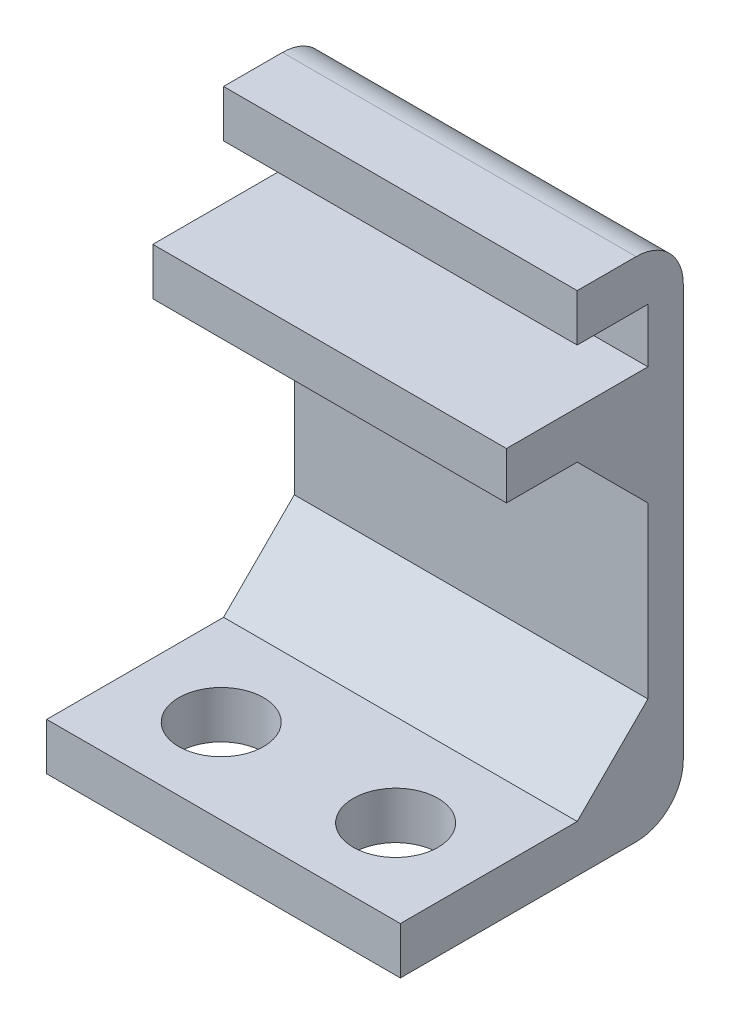
ISO-10303-21;
HEADER;
FILE_DESCRIPTION(('STEP AP214'),'2;1');
FILE_NAME('part.step','',(''),(''),'','','');
FILE_SCHEMA(('AUTOMOTIVE_DESIGN { 1 0 10303 214 1 1 1 1 }'));
ENDSEC;
DATA;
#1=APPLICATION_CONTEXT('core data for automotive mechanical design processes');
#2=APPLICATION_PROTOCOL_DEFINITION('international standard','automotive_design',2000,#1);
#3=PRODUCT_CONTEXT('',#1,'mechanical');
#4=PRODUCT('Part','Part','',(#3));
#5=PRODUCT_RELATED_PRODUCT_CATEGORY('part','',(#4));
#6=PRODUCT_DEFINITION_FORMATION('','',#4);
#7=PRODUCT_DEFINITION_CONTEXT('part definition',#1,'design');
#8=PRODUCT_DEFINITION('design','',#6,#7);
#9=PRODUCT_DEFINITION_SHAPE('','',#8);
#10=(LENGTH_UNIT() NAMED_UNIT(*) SI_UNIT(.MILLI.,.METRE.));
#11=(NAMED_UNIT(*) PLANE_ANGLE_UNIT() SI_UNIT($,.RADIAN.));
#12=(NAMED_UNIT(*) SI_UNIT($,.STERADIAN.) SOLID_ANGLE_UNIT());
#13=UNCERTAINTY_MEASURE_WITH_UNIT(LENGTH_MEASURE(1.E-05),#10,'distance_accuracy_value','');
#14=(GEOMETRIC_REPRESENTATION_CONTEXT(3) GLOBAL_UNCERTAINTY_ASSIGNED_CONTEXT((#13)) GLOBAL_UNIT_ASSIGNED_CONTEXT((#10,
#11,#12)) REPRESENTATION_CONTEXT('',''));
#15=CARTESIAN_POINT('',(0.,0.,0.));
#16=DIRECTION('',(0.,0.,1.));
#17=DIRECTION('',(1.,0.,0.));
#18=AXIS2_PLACEMENT_3D('',#15,#16,#17);
#19=CARTESIAN_POINT('',(7.5,0.,0.749999999999999));
#20=DIRECTION('',(0.,0.,-1.));
#21=DIRECTION('',(0.,1.,0.));
#22=AXIS2_PLACEMENT_3D('',#19,#20,#21);
#23=PLANE('',#22);
#24=DIRECTION('',(0.,-1.,0.));
#25=VECTOR('',#24,1.);
#26=CARTESIAN_POINT('',(-7.5,0.,0.749999999999999));
#27=LINE('',#26,#25);
#28=CARTESIAN_POINT('',(-7.5,6.45,0.750000000000001));
#29=VERTEX_POINT('',#28);
#30=CARTESIAN_POINT('',(-7.5,4.45,0.75));
#31=VERTEX_POINT('',#30);
#32=EDGE_CURVE('E180',#29,#31,#27,.T.);
#33=ORIENTED_EDGE('',*,*,#32,.T.);
#34=DIRECTION('',(-1.,0.,0.));
#35=VECTOR('',#34,1.);
#36=CARTESIAN_POINT('',(7.5,4.45,0.75));
#37=LINE('',#36,#35);
#38=CARTESIAN_POINT('',(7.5,4.45,0.75));
#39=VERTEX_POINT('',#38);
#40=EDGE_CURVE('E163',#39,#31,#37,.T.);
#41=ORIENTED_EDGE('',*,*,#40,.F.);
#42=DIRECTION('',(0.,-1.,0.));
#43=VECTOR('',#42,1.);
#44=CARTESIAN_POINT('',(7.5,0.,0.749999999999999));
#45=LINE('',#44,#43);
#46=CARTESIAN_POINT('',(7.5,6.45,0.750000000000001));
#47=VERTEX_POINT('',#46);
#48=EDGE_CURVE('E169',#47,#39,#45,.T.);
#49=ORIENTED_EDGE('',*,*,#48,.F.);
#50=DIRECTION('',(-1.,0.,0.));
#51=VECTOR('',#50,1.);
#52=CARTESIAN_POINT('',(7.5,6.45,0.750000000000001));
#53=LINE('',#52,#51);
#54=EDGE_CURVE('E256',#47,#29,#53,.T.);
#55=ORIENTED_EDGE('',*,*,#54,.T.);
#56=EDGE_LOOP('',(#33,#41,#49,#55));
#57=FACE_BOUND('',#56,.T.);
#58=ADVANCED_FACE('F41',(#57),#23,.F.);
#59=CARTESIAN_POINT('',(7.5,4.45,0.));
#60=DIRECTION('',(0.,1.,0.));
#61=DIRECTION('',(0.,0.,1.));
#62=AXIS2_PLACEMENT_3D('',#59,#60,#61);
#63=PLANE('',#62);
#64=DIRECTION('',(0.,0.,-1.));
#65=VECTOR('',#64,1.);
#66=CARTESIAN_POINT('',(-7.5,4.45,0.));
#67=LINE('',#66,#65);
#68=CARTESIAN_POINT('',(-7.5,4.45,-2.25000000000001));
#69=VERTEX_POINT('',#68);
#70=EDGE_CURVE('E337',#31,#69,#67,.T.);
#71=ORIENTED_EDGE('',*,*,#70,.T.);
#72=DIRECTION('',(1.,0.,0.));
#73=VECTOR('',#72,1.);
#74=CARTESIAN_POINT('',(7.5,4.45,-2.25000000000001));
#75=LINE('',#74,#73);
#76=CARTESIAN_POINT('',(7.5,4.45,-2.25000000000001));
#77=VERTEX_POINT('',#76);
#78=EDGE_CURVE('E166',#69,#77,#75,.T.);
#79=ORIENTED_EDGE('',*,*,#78,.T.);
#80=DIRECTION('',(0.,0.,-1.));
#81=VECTOR('',#80,1.);
#82=CARTESIAN_POINT('',(7.5,4.45,0.));
#83=LINE('',#82,#81);
#84=EDGE_CURVE('E158',#39,#77,#83,.T.);
#85=ORIENTED_EDGE('',*,*,#84,.F.);
#86=ORIENTED_EDGE('',*,*,#40,.T.);
#87=EDGE_LOOP('',(#71,#79,#85,#86));
#88=FACE_BOUND('',#87,.T.);
#89=ADVANCED_FACE('F161',(#88),#63,.F.);
#90=CARTESIAN_POINT('',(7.5,0.,-5.25));
#91=DIRECTION('',(0.,0.,-1.));
#92=DIRECTION('',(-1.,0.,0.));
#93=AXIS2_PLACEMENT_3D('',#90,#91,#92);
#94=PLANE('',#93);
#95=DIRECTION('',(0.,-1.,0.));
#96=VECTOR('',#95,1.);
#97=CARTESIAN_POINT('',(-7.5,0.,-5.25));
#98=LINE('',#97,#96);
#99=CARTESIAN_POINT('',(-7.5,1.44999999999998,-5.25));
#100=VERTEX_POINT('',#99);
#101=CARTESIAN_POINT('',(-7.5,-5.75000000000001,-5.25));
#102=VERTEX_POINT('',#101);
#103=EDGE_CURVE('E340',#100,#102,#98,.T.);
#104=ORIENTED_EDGE('',*,*,#103,.T.);
#105=DIRECTION('',(1.,0.,0.));
#106=VECTOR('',#105,1.);
#107=CARTESIAN_POINT('',(7.5,-5.75000000000001,-5.25));
#108=LINE('',#107,#106);
#109=CARTESIAN_POINT('',(7.5,-5.75000000000001,-5.25));
#110=VERTEX_POINT('',#109);
#111=EDGE_CURVE('E193',#102,#110,#108,.T.);
#112=ORIENTED_EDGE('',*,*,#111,.T.);
#113=DIRECTION('',(0.,-1.,0.));
#114=VECTOR('',#113,1.);
#115=CARTESIAN_POINT('',(7.5,0.,-5.25));
#116=LINE('',#115,#114);
#117=CARTESIAN_POINT('',(7.5,1.44999999999998,-5.25));
#118=VERTEX_POINT('',#117);
#119=EDGE_CURVE('E168',#118,#110,#116,.T.);
#120=ORIENTED_EDGE('',*,*,#119,.F.);
#121=DIRECTION('',(-1.,0.,0.));
#122=VECTOR('',#121,1.);
#123=CARTESIAN_POINT('',(-7.5,1.44999999999998,-5.25));
#124=LINE('',#123,#122);
#125=EDGE_CURVE('E185',#118,#100,#124,.T.);
#126=ORIENTED_EDGE('',*,*,#125,.T.);
#127=EDGE_LOOP('',(#104,#112,#120,#126));
#128=FACE_BOUND('',#127,.T.);
#129=ADVANCED_FACE('F290',(#128),#94,.F.);
#130=CARTESIAN_POINT('',(7.5,-8.75,0.));
#131=DIRECTION('',(0.,1.,0.));
#132=DIRECTION('',(0.,0.,1.));
#133=AXIS2_PLACEMENT_3D('',#130,#131,#132);
#134=PLANE('',#133);
#135=CARTESIAN_POINT('',(-3.7,-8.75,1.65));
#136=DIRECTION('',(0.,1.,0.));
#137=DIRECTION('',(0.,0.,1.));
#138=AXIS2_PLACEMENT_3D('',#135,#136,#137);
#139=CIRCLE('',#138,1.8);
#140=CARTESIAN_POINT('',(-3.7,-8.75,3.45));
#141=VERTEX_POINT('',#140);
#142=EDGE_CURVE('E338',#141,#141,#139,.F.);
#143=ORIENTED_EDGE('',*,*,#142,.T.);
#144=EDGE_LOOP('',(#143));
#145=FACE_BOUND('',#144,.T.);
#146=CARTESIAN_POINT('',(3.7,-8.75,1.65));
#147=DIRECTION('',(0.,1.,0.));
#148=DIRECTION('',(0.,0.,1.));
#149=AXIS2_PLACEMENT_3D('',#146,#147,#148);
#150=CIRCLE('',#149,1.8);
#151=CARTESIAN_POINT('',(3.7,-8.75,3.45));
#152=VERTEX_POINT('',#151);
#153=EDGE_CURVE('E509',#152,#152,#150,.F.);
#154=ORIENTED_EDGE('',*,*,#153,.T.);
#155=EDGE_LOOP('',(#154));
#156=FACE_BOUND('',#155,.T.);
#157=DIRECTION('',(0.,0.,-1.));
#158=VECTOR('',#157,1.);
#159=CARTESIAN_POINT('',(7.5,-8.75,0.));
#160=LINE('',#159,#158);
#161=CARTESIAN_POINT('',(7.5,-8.75,5.25));
#162=VERTEX_POINT('',#161);
#163=CARTESIAN_POINT('',(7.5,-8.75,-2.24999999999998));
#164=VERTEX_POINT('',#163);
#165=EDGE_CURVE('E321',#162,#164,#160,.T.);
#166=ORIENTED_EDGE('',*,*,#165,.T.);
#167=DIRECTION('',(-1.,0.,0.));
#168=VECTOR('',#167,1.);
#169=CARTESIAN_POINT('',(7.5,-8.75,-2.24999999999998));
#170=LINE('',#169,#168);
#171=CARTESIAN_POINT('',(-7.5,-8.75,-2.24999999999998));
#172=VERTEX_POINT('',#171);
#173=EDGE_CURVE('E181',#164,#172,#170,.T.);
#174=ORIENTED_EDGE('',*,*,#173,.T.);
#175=DIRECTION('',(0.,0.,-1.));
#176=VECTOR('',#175,1.);
#177=CARTESIAN_POINT('',(-7.5,-8.75,0.));
#178=LINE('',#177,#176);
#179=CARTESIAN_POINT('',(-7.5,-8.75,5.25));
#180=VERTEX_POINT('',#179);
#181=EDGE_CURVE('E241',#180,#172,#178,.T.);
#182=ORIENTED_EDGE('',*,*,#181,.F.);
#183=DIRECTION('',(-1.,0.,0.));
#184=VECTOR('',#183,1.);
#185=CARTESIAN_POINT('',(7.5,-8.75,5.25));
#186=LINE('',#185,#184);
#187=EDGE_CURVE('E182',#162,#180,#186,.T.);
#188=ORIENTED_EDGE('',*,*,#187,.F.);
#189=EDGE_LOOP('',(#166,#174,#182,#188));
#190=FACE_BOUND('',#189,.T.);
#191=ADVANCED_FACE('F344',(#145,#156,#190),#134,.T.);
#192=CARTESIAN_POINT('',(7.5,0.,5.25000000000001));
#193=DIRECTION('',(0.,0.,-1.));
#194=DIRECTION('',(0.,1.,0.));
#195=AXIS2_PLACEMENT_3D('',#192,#193,#194);
#196=PLANE('',#195);
#197=DIRECTION('',(0.,-1.,0.));
#198=VECTOR('',#197,1.);
#199=CARTESIAN_POINT('',(-7.5,0.,5.25000000000001));
#200=LINE('',#199,#198);
#201=CARTESIAN_POINT('',(-7.5,-10.75,5.25));
#202=VERTEX_POINT('',#201);
#203=EDGE_CURVE('E237',#180,#202,#200,.T.);
#204=ORIENTED_EDGE('',*,*,#203,.T.);
#205=DIRECTION('',(-1.,0.,0.));
#206=VECTOR('',#205,1.);
#207=CARTESIAN_POINT('',(7.5,-10.75,5.25));
#208=LINE('',#207,#206);
#209=CARTESIAN_POINT('',(7.5,-10.75,5.25));
#210=VERTEX_POINT('',#209);
#211=EDGE_CURVE('E187',#210,#202,#208,.T.);
#212=ORIENTED_EDGE('',*,*,#211,.F.);
#213=DIRECTION('',(0.,-1.,0.));
#214=VECTOR('',#213,1.);
#215=CARTESIAN_POINT('',(7.5,0.,5.25000000000001));
#216=LINE('',#215,#214);
#217=EDGE_CURVE('E324',#162,#210,#216,.T.);
#218=ORIENTED_EDGE('',*,*,#217,.F.);
#219=ORIENTED_EDGE('',*,*,#187,.T.);
#220=EDGE_LOOP('',(#204,#212,#218,#219));
#221=FACE_BOUND('',#220,.T.);
#222=ADVANCED_FACE('F349',(#221),#196,.F.);
#223=CARTESIAN_POINT('',(7.5,-10.75,0.));
#224=DIRECTION('',(0.,1.,0.));
#225=DIRECTION('',(0.,0.,1.));
#226=AXIS2_PLACEMENT_3D('',#223,#224,#225);
#227=PLANE('',#226);
#228=CARTESIAN_POINT('',(-3.7,-10.75,1.65));
#229=DIRECTION('',(0.,1.,0.));
#230=DIRECTION('',(0.,0.,1.));
#231=AXIS2_PLACEMENT_3D('',#228,#229,#230);
#232=CIRCLE('',#231,1.8);
#233=CARTESIAN_POINT('',(-3.7,-10.75,3.45));
#234=VERTEX_POINT('',#233);
#235=EDGE_CURVE('E508',#234,#234,#232,.T.);
#236=ORIENTED_EDGE('',*,*,#235,.T.);
#237=EDGE_LOOP('',(#236));
#238=FACE_BOUND('',#237,.T.);
#239=CARTESIAN_POINT('',(3.7,-10.75,1.65));
#240=DIRECTION('',(0.,1.,0.));
#241=DIRECTION('',(0.,0.,-1.));
#242=AXIS2_PLACEMENT_3D('',#239,#240,#241);
#243=CIRCLE('',#242,1.8);
#244=CARTESIAN_POINT('',(3.7,-10.75,-0.150000000000001));
#245=VERTEX_POINT('',#244);
#246=EDGE_CURVE('E510',#245,#245,#243,.T.);
#247=ORIENTED_EDGE('',*,*,#246,.T.);
#248=EDGE_LOOP('',(#247));
#249=FACE_BOUND('',#248,.T.);
#250=DIRECTION('',(0.,0.,-1.));
#251=VECTOR('',#250,1.);
#252=CARTESIAN_POINT('',(-7.5,-10.75,0.));
#253=LINE('',#252,#251);
#254=CARTESIAN_POINT('',(-7.5,-10.75,-4.75));
#255=VERTEX_POINT('',#254);
#256=EDGE_CURVE('E232',#202,#255,#253,.T.);
#257=ORIENTED_EDGE('',*,*,#256,.T.);
#258=DIRECTION('',(-1.,0.,0.));
#259=VECTOR('',#258,1.);
#260=CARTESIAN_POINT('',(7.5,-10.75,-4.75));
#261=LINE('',#260,#259);
#262=CARTESIAN_POINT('',(7.5,-10.75,-4.75));
#263=VERTEX_POINT('',#262);
#264=EDGE_CURVE('E64',#255,#263,#261,.F.);
#265=ORIENTED_EDGE('',*,*,#264,.T.);
#266=DIRECTION('',(0.,0.,-1.));
#267=VECTOR('',#266,1.);
#268=CARTESIAN_POINT('',(7.5,-10.75,0.));
#269=LINE('',#268,#267);
#270=EDGE_CURVE('E217',#210,#263,#269,.T.);
#271=ORIENTED_EDGE('',*,*,#270,.F.);
#272=ORIENTED_EDGE('',*,*,#211,.T.);
#273=EDGE_LOOP('',(#257,#265,#271,#272));
#274=FACE_BOUND('',#273,.T.);
#275=ADVANCED_FACE('F235',(#238,#249,#274),#227,.F.);
#276=CARTESIAN_POINT('',(7.5,0.,-6.75));
#277=DIRECTION('',(0.,0.,-1.));
#278=DIRECTION('',(0.,1.,0.));
#279=AXIS2_PLACEMENT_3D('',#276,#277,#278);
#280=PLANE('',#279);
#281=DIRECTION('',(0.,-1.,0.));
#282=VECTOR('',#281,1.);
#283=CARTESIAN_POINT('',(7.5,0.,-6.75));
#284=LINE('',#283,#282);
#285=CARTESIAN_POINT('',(7.5,8.75,-6.75000000000001));
#286=VERTEX_POINT('',#285);
#287=CARTESIAN_POINT('',(7.5,-8.75,-6.75));
#288=VERTEX_POINT('',#287);
#289=EDGE_CURVE('E216',#286,#288,#284,.T.);
#290=ORIENTED_EDGE('',*,*,#289,.T.);
#291=DIRECTION('',(-1.,0.,0.));
#292=VECTOR('',#291,1.);
#293=CARTESIAN_POINT('',(-7.5,-8.75,-6.75));
#294=LINE('',#293,#292);
#295=CARTESIAN_POINT('',(-7.5,-8.75,-6.75));
#296=VERTEX_POINT('',#295);
#297=EDGE_CURVE('E206',#288,#296,#294,.T.);
#298=ORIENTED_EDGE('',*,*,#297,.T.);
#299=DIRECTION('',(0.,-1.,0.));
#300=VECTOR('',#299,1.);
#301=CARTESIAN_POINT('',(-7.5,0.,-6.75));
#302=LINE('',#301,#300);
#303=CARTESIAN_POINT('',(-7.5,8.75,-6.75000000000001));
#304=VERTEX_POINT('',#303);
#305=EDGE_CURVE('E233',#304,#296,#302,.T.);
#306=ORIENTED_EDGE('',*,*,#305,.F.);
#307=DIRECTION('',(-1.,0.,0.));
#308=VECTOR('',#307,1.);
#309=CARTESIAN_POINT('',(7.5,8.75,-6.75000000000001));
#310=LINE('',#309,#308);
#311=EDGE_CURVE('E204',#304,#286,#310,.F.);
#312=ORIENTED_EDGE('',*,*,#311,.T.);
#313=EDGE_LOOP('',(#290,#298,#306,#312));
#314=FACE_BOUND('',#313,.T.);
#315=ADVANCED_FACE('F221',(#314),#280,.T.);
#316=CARTESIAN_POINT('',(7.5,10.75,0.));
#317=DIRECTION('',(0.,1.,0.));
#318=DIRECTION('',(0.,0.,1.));
#319=AXIS2_PLACEMENT_3D('',#316,#317,#318);
#320=PLANE('',#319);
#321=DIRECTION('',(0.,0.,-1.));
#322=VECTOR('',#321,1.);
#323=CARTESIAN_POINT('',(7.5,10.75,0.));
#324=LINE('',#323,#322);
#325=CARTESIAN_POINT('',(7.5,10.75,-2.25000000000001));
#326=VERTEX_POINT('',#325);
#327=CARTESIAN_POINT('',(7.5,10.75,-4.75000000000001));
#328=VERTEX_POINT('',#327);
#329=EDGE_CURVE('E225',#326,#328,#324,.T.);
#330=ORIENTED_EDGE('',*,*,#329,.T.);
#331=DIRECTION('',(-1.,0.,0.));
#332=VECTOR('',#331,1.);
#333=CARTESIAN_POINT('',(7.5,10.75,-4.75000000000001));
#334=LINE('',#333,#332);
#335=CARTESIAN_POINT('',(-7.5,10.75,-4.75000000000001));
#336=VERTEX_POINT('',#335);
#337=EDGE_CURVE('E11',#328,#336,#334,.T.);
#338=ORIENTED_EDGE('',*,*,#337,.T.);
#339=DIRECTION('',(0.,0.,-1.));
#340=VECTOR('',#339,1.);
#341=CARTESIAN_POINT('',(-7.5,10.75,0.));
#342=LINE('',#341,#340);
#343=CARTESIAN_POINT('',(-7.5,10.75,-2.25000000000001));
#344=VERTEX_POINT('',#343);
#345=EDGE_CURVE('E239',#344,#336,#342,.T.);
#346=ORIENTED_EDGE('',*,*,#345,.F.);
#347=DIRECTION('',(-1.,0.,0.));
#348=VECTOR('',#347,1.);
#349=CARTESIAN_POINT('',(7.5,10.75,-2.25000000000001));
#350=LINE('',#349,#348);
#351=EDGE_CURVE('E266',#326,#344,#350,.T.);
#352=ORIENTED_EDGE('',*,*,#351,.F.);
#353=EDGE_LOOP('',(#330,#338,#346,#352));
#354=FACE_BOUND('',#353,.T.);
#355=ADVANCED_FACE('F277',(#354),#320,.T.);
#356=CARTESIAN_POINT('',(7.5,0.,-2.25000000000001));
#357=DIRECTION('',(0.,0.,-1.));
#358=DIRECTION('',(0.,1.,0.));
#359=AXIS2_PLACEMENT_3D('',#356,#357,#358);
#360=PLANE('',#359);
#361=DIRECTION('',(0.,-1.,0.));
#362=VECTOR('',#361,1.);
#363=CARTESIAN_POINT('',(-7.5,0.,-2.25000000000001));
#364=LINE('',#363,#362);
#365=CARTESIAN_POINT('',(-7.5,8.75,-2.25000000000001));
#366=VERTEX_POINT('',#365);
#367=EDGE_CURVE('E247',#344,#366,#364,.T.);
#368=ORIENTED_EDGE('',*,*,#367,.T.);
#369=DIRECTION('',(-1.,0.,0.));
#370=VECTOR('',#369,1.);
#371=CARTESIAN_POINT('',(7.5,8.75,-2.25000000000001));
#372=LINE('',#371,#370);
#373=CARTESIAN_POINT('',(7.5,8.75,-2.25000000000001));
#374=VERTEX_POINT('',#373);
#375=EDGE_CURVE('E263',#374,#366,#372,.T.);
#376=ORIENTED_EDGE('',*,*,#375,.F.);
#377=DIRECTION('',(0.,-1.,0.));
#378=VECTOR('',#377,1.);
#379=CARTESIAN_POINT('',(7.5,0.,-2.25000000000001));
#380=LINE('',#379,#378);
#381=EDGE_CURVE('E272',#326,#374,#380,.T.);
#382=ORIENTED_EDGE('',*,*,#381,.F.);
#383=ORIENTED_EDGE('',*,*,#351,.T.);
#384=EDGE_LOOP('',(#368,#376,#382,#383));
#385=FACE_BOUND('',#384,.T.);
#386=ADVANCED_FACE('F270',(#385),#360,.F.);
#387=CARTESIAN_POINT('',(7.5,8.75,0.));
#388=DIRECTION('',(0.,1.,0.));
#389=DIRECTION('',(0.,0.,1.));
#390=AXIS2_PLACEMENT_3D('',#387,#388,#389);
#391=PLANE('',#390);
#392=DIRECTION('',(0.,0.,-1.));
#393=VECTOR('',#392,1.);
#394=CARTESIAN_POINT('',(-7.5,8.75,0.));
#395=LINE('',#394,#393);
#396=CARTESIAN_POINT('',(-7.5,8.75,-5.25));
#397=VERTEX_POINT('',#396);
#398=EDGE_CURVE('E249',#366,#397,#395,.T.);
#399=ORIENTED_EDGE('',*,*,#398,.T.);
#400=DIRECTION('',(-1.,0.,0.));
#401=VECTOR('',#400,1.);
#402=CARTESIAN_POINT('',(7.5,8.75,-5.25));
#403=LINE('',#402,#401);
#404=CARTESIAN_POINT('',(7.5,8.75,-5.25));
#405=VERTEX_POINT('',#404);
#406=EDGE_CURVE('E260',#405,#397,#403,.T.);
#407=ORIENTED_EDGE('',*,*,#406,.F.);
#408=DIRECTION('',(0.,0.,-1.));
#409=VECTOR('',#408,1.);
#410=CARTESIAN_POINT('',(7.5,8.75,0.));
#411=LINE('',#410,#409);
#412=EDGE_CURVE('E331',#374,#405,#411,.T.);
#413=ORIENTED_EDGE('',*,*,#412,.F.);
#414=ORIENTED_EDGE('',*,*,#375,.T.);
#415=EDGE_LOOP('',(#399,#407,#413,#414));
#416=FACE_BOUND('',#415,.T.);
#417=ADVANCED_FACE('F458',(#416),#391,.F.);
#418=CARTESIAN_POINT('',(7.5,0.,-5.25));
#419=DIRECTION('',(0.,0.,-1.));
#420=DIRECTION('',(-1.,0.,0.));
#421=AXIS2_PLACEMENT_3D('',#418,#419,#420);
#422=PLANE('',#421);
#423=DIRECTION('',(0.,-1.,0.));
#424=VECTOR('',#423,1.);
#425=CARTESIAN_POINT('',(-7.5,0.,-5.25));
#426=LINE('',#425,#424);
#427=CARTESIAN_POINT('',(-7.5,6.45,-5.25));
#428=VERTEX_POINT('',#427);
#429=EDGE_CURVE('E251',#397,#428,#426,.T.);
#430=ORIENTED_EDGE('',*,*,#429,.T.);
#431=DIRECTION('',(-1.,0.,0.));
#432=VECTOR('',#431,1.);
#433=CARTESIAN_POINT('',(7.5,6.45,-5.25));
#434=LINE('',#433,#432);
#435=CARTESIAN_POINT('',(7.5,6.45,-5.25));
#436=VERTEX_POINT('',#435);
#437=EDGE_CURVE('E258',#436,#428,#434,.T.);
#438=ORIENTED_EDGE('',*,*,#437,.F.);
#439=DIRECTION('',(0.,-1.,0.));
#440=VECTOR('',#439,1.);
#441=CARTESIAN_POINT('',(7.5,0.,-5.25));
#442=LINE('',#441,#440);
#443=EDGE_CURVE('E333',#405,#436,#442,.T.);
#444=ORIENTED_EDGE('',*,*,#443,.F.);
#445=ORIENTED_EDGE('',*,*,#406,.T.);
#446=EDGE_LOOP('',(#430,#438,#444,#445));
#447=FACE_BOUND('',#446,.T.);
#448=ADVANCED_FACE('F454',(#447),#422,.F.);
#449=CARTESIAN_POINT('',(7.5,6.45,0.));
#450=DIRECTION('',(0.,1.,0.));
#451=DIRECTION('',(0.,0.,1.));
#452=AXIS2_PLACEMENT_3D('',#449,#450,#451);
#453=PLANE('',#452);
#454=DIRECTION('',(0.,0.,-1.));
#455=VECTOR('',#454,1.);
#456=CARTESIAN_POINT('',(-7.5,6.45,0.));
#457=LINE('',#456,#455);
#458=EDGE_CURVE('E177',#29,#428,#457,.T.);
#459=ORIENTED_EDGE('',*,*,#458,.F.);
#460=ORIENTED_EDGE('',*,*,#54,.F.);
#461=DIRECTION('',(0.,0.,-1.));
#462=VECTOR('',#461,1.);
#463=CARTESIAN_POINT('',(7.5,6.45,0.));
#464=LINE('',#463,#462);
#465=EDGE_CURVE('E175',#47,#436,#464,.T.);
#466=ORIENTED_EDGE('',*,*,#465,.T.);
#467=ORIENTED_EDGE('',*,*,#437,.T.);
#468=EDGE_LOOP('',(#459,#460,#466,#467));
#469=FACE_BOUND('',#468,.T.);
#470=ADVANCED_FACE('F422',(#469),#453,.T.);
#471=CARTESIAN_POINT('',(7.5,0.,0.));
#472=DIRECTION('',(1.,0.,0.));
#473=DIRECTION('',(0.,0.,-1.));
#474=AXIS2_PLACEMENT_3D('',#471,#472,#473);
#475=PLANE('',#474);
#476=ORIENTED_EDGE('',*,*,#270,.T.);
#477=CARTESIAN_POINT('',(7.5,-8.75,-4.75));
#478=DIRECTION('',(1.,0.,0.));
#479=DIRECTION('',(0.,0.,-1.));
#480=AXIS2_PLACEMENT_3D('',#477,#478,#479);
#481=CIRCLE('',#480,2.);
#482=EDGE_CURVE('E49',#263,#288,#481,.T.);
#483=ORIENTED_EDGE('',*,*,#482,.T.);
#484=ORIENTED_EDGE('',*,*,#289,.F.);
#485=CARTESIAN_POINT('',(7.5,8.75,-4.75000000000001));
#486=DIRECTION('',(1.,0.,0.));
#487=DIRECTION('',(0.,0.,-1.));
#488=AXIS2_PLACEMENT_3D('',#485,#486,#487);
#489=CIRCLE('',#488,2.);
#490=EDGE_CURVE('E56',#286,#328,#489,.T.);
#491=ORIENTED_EDGE('',*,*,#490,.T.);
#492=ORIENTED_EDGE('',*,*,#329,.F.);
#493=ORIENTED_EDGE('',*,*,#381,.T.);
#494=ORIENTED_EDGE('',*,*,#412,.T.);
#495=ORIENTED_EDGE('',*,*,#443,.T.);
#496=ORIENTED_EDGE('',*,*,#465,.F.);
#497=ORIENTED_EDGE('',*,*,#48,.T.);
#498=ORIENTED_EDGE('',*,*,#84,.T.);
#499=DIRECTION('',(0.,0.707106781186551,0.707106781186544));
#500=VECTOR('',#499,1.);
#501=CARTESIAN_POINT('',(7.5,1.44999999999998,-5.25));
#502=LINE('',#501,#500);
#503=EDGE_CURVE('E202',#77,#118,#502,.F.);
#504=ORIENTED_EDGE('',*,*,#503,.T.);
#505=ORIENTED_EDGE('',*,*,#119,.T.);
#506=DIRECTION('',(0.,-0.707106781186544,0.707106781186551));
#507=VECTOR('',#506,1.);
#508=CARTESIAN_POINT('',(7.5,-8.75,-2.24999999999998));
#509=LINE('',#508,#507);
#510=EDGE_CURVE('E198',#110,#164,#509,.T.);
#511=ORIENTED_EDGE('',*,*,#510,.T.);
#512=ORIENTED_EDGE('',*,*,#165,.F.);
#513=ORIENTED_EDGE('',*,*,#217,.T.);
#514=EDGE_LOOP('',(#476,#483,#484,#491,#492,#493,#494,#495,#496,#497,#498,#504,#505,#511,#512,#513));
#515=FACE_BOUND('',#514,.T.);
#516=ADVANCED_FACE('F173',(#515),#475,.T.);
#517=CARTESIAN_POINT('',(-7.5,0.,0.));
#518=DIRECTION('',(1.,0.,0.));
#519=DIRECTION('',(0.,0.,-1.));
#520=AXIS2_PLACEMENT_3D('',#517,#518,#519);
#521=PLANE('',#520);
#522=ORIENTED_EDGE('',*,*,#305,.T.);
#523=CARTESIAN_POINT('',(-7.5,-8.75,-4.75));
#524=DIRECTION('',(1.,0.,0.));
#525=DIRECTION('',(0.,0.,-1.));
#526=AXIS2_PLACEMENT_3D('',#523,#524,#525);
#527=CIRCLE('',#526,2.);
#528=EDGE_CURVE('E211',#296,#255,#527,.F.);
#529=ORIENTED_EDGE('',*,*,#528,.T.);
#530=ORIENTED_EDGE('',*,*,#256,.F.);
#531=ORIENTED_EDGE('',*,*,#203,.F.);
#532=ORIENTED_EDGE('',*,*,#181,.T.);
#533=DIRECTION('',(0.,0.707106781186544,-0.707106781186551));
#534=VECTOR('',#533,1.);
#535=CARTESIAN_POINT('',(-7.5,-5.50000000000004,-5.49999999999998));
#536=LINE('',#535,#534);
#537=EDGE_CURVE('E196',#172,#102,#536,.T.);
#538=ORIENTED_EDGE('',*,*,#537,.T.);
#539=ORIENTED_EDGE('',*,*,#103,.F.);
#540=DIRECTION('',(0.,-0.707106781186551,-0.707106781186544));
#541=VECTOR('',#540,1.);
#542=CARTESIAN_POINT('',(-7.5,3.34999999999998,-3.35000000000002));
#543=LINE('',#542,#541);
#544=EDGE_CURVE('E200',#100,#69,#543,.F.);
#545=ORIENTED_EDGE('',*,*,#544,.T.);
#546=ORIENTED_EDGE('',*,*,#70,.F.);
#547=ORIENTED_EDGE('',*,*,#32,.F.);
#548=ORIENTED_EDGE('',*,*,#458,.T.);
#549=ORIENTED_EDGE('',*,*,#429,.F.);
#550=ORIENTED_EDGE('',*,*,#398,.F.);
#551=ORIENTED_EDGE('',*,*,#367,.F.);
#552=ORIENTED_EDGE('',*,*,#345,.T.);
#553=CARTESIAN_POINT('',(-7.5,8.75,-4.75000000000001));
#554=DIRECTION('',(1.,0.,0.));
#555=DIRECTION('',(0.,0.,-1.));
#556=AXIS2_PLACEMENT_3D('',#553,#554,#555);
#557=CIRCLE('',#556,2.);
#558=EDGE_CURVE('E209',#336,#304,#557,.F.);
#559=ORIENTED_EDGE('',*,*,#558,.T.);
#560=EDGE_LOOP('',(#522,#529,#530,#531,#532,#538,#539,#545,#546,#547,#548,#549,#550,#551,#552,#559));
#561=FACE_BOUND('',#560,.T.);
#562=ADVANCED_FACE('F230',(#561),#521,.F.);
#563=CARTESIAN_POINT('',(7.5,-8.75,-2.24999999999998));
#564=DIRECTION('',(0.,-0.707106781186551,-0.707106781186544));
#565=DIRECTION('',(-1.,0.,0.));
#566=AXIS2_PLACEMENT_3D('',#563,#564,#565);
#567=PLANE('',#566);
#568=ORIENTED_EDGE('',*,*,#510,.F.);
#569=ORIENTED_EDGE('',*,*,#111,.F.);
#570=ORIENTED_EDGE('',*,*,#537,.F.);
#571=ORIENTED_EDGE('',*,*,#173,.F.);
#572=EDGE_LOOP('',(#568,#569,#570,#571));
#573=FACE_BOUND('',#572,.T.);
#574=ADVANCED_FACE('F295',(#573),#567,.F.);
#575=CARTESIAN_POINT('',(7.5,1.44999999999998,-5.25));
#576=DIRECTION('',(0.,-0.707106781186544,0.707106781186551));
#577=DIRECTION('',(1.,0.,0.));
#578=AXIS2_PLACEMENT_3D('',#575,#576,#577);
#579=PLANE('',#578);
#580=ORIENTED_EDGE('',*,*,#503,.F.);
#581=ORIENTED_EDGE('',*,*,#78,.F.);
#582=ORIENTED_EDGE('',*,*,#544,.F.);
#583=ORIENTED_EDGE('',*,*,#125,.F.);
#584=EDGE_LOOP('',(#580,#581,#582,#583));
#585=FACE_BOUND('',#584,.T.);
#586=ADVANCED_FACE('F301',(#585),#579,.T.);
#587=CARTESIAN_POINT('',(3.7,-5.75,1.65));
#588=DIRECTION('',(0.,-1.,0.));
#589=DIRECTION('',(0.,0.,-1.));
#590=AXIS2_PLACEMENT_3D('',#587,#588,#589);
#591=CYLINDRICAL_SURFACE('',#590,1.8);
#592=ORIENTED_EDGE('',*,*,#153,.F.);
#593=EDGE_LOOP('',(#592));
#594=FACE_BOUND('',#593,.T.);
#595=ORIENTED_EDGE('',*,*,#246,.F.);
#596=EDGE_LOOP('',(#595));
#597=FACE_BOUND('',#596,.T.);
#598=ADVANCED_FACE('F306',(#594,#597),#591,.F.);
#599=CARTESIAN_POINT('',(-3.7,-5.75,1.65));
#600=DIRECTION('',(0.,-1.,0.));
#601=DIRECTION('',(0.,0.,-1.));
#602=AXIS2_PLACEMENT_3D('',#599,#600,#601);
#603=CYLINDRICAL_SURFACE('',#602,1.8);
#604=ORIENTED_EDGE('',*,*,#142,.F.);
#605=EDGE_LOOP('',(#604));
#606=FACE_BOUND('',#605,.T.);
#607=ORIENTED_EDGE('',*,*,#235,.F.);
#608=EDGE_LOOP('',(#607));
#609=FACE_BOUND('',#608,.T.);
#610=ADVANCED_FACE('F284',(#606,#609),#603,.F.);
#611=CARTESIAN_POINT('',(7.5,-8.75,-4.75));
#612=DIRECTION('',(1.,0.,0.));
#613=DIRECTION('',(0.,0.,-1.));
#614=AXIS2_PLACEMENT_3D('',#611,#612,#613);
#615=CYLINDRICAL_SURFACE('',#614,2.);
#616=ORIENTED_EDGE('',*,*,#482,.F.);
#617=ORIENTED_EDGE('',*,*,#264,.F.);
#618=ORIENTED_EDGE('',*,*,#528,.F.);
#619=ORIENTED_EDGE('',*,*,#297,.F.);
#620=EDGE_LOOP('',(#616,#617,#618,#619));
#621=FACE_BOUND('',#620,.T.);
#622=ADVANCED_FACE('F227',(#621),#615,.T.);
#623=CARTESIAN_POINT('',(7.5,8.75,-4.75000000000001));
#624=DIRECTION('',(-1.,0.,0.));
#625=DIRECTION('',(0.,0.,1.));
#626=AXIS2_PLACEMENT_3D('',#623,#624,#625);
#627=CYLINDRICAL_SURFACE('',#626,2.);
#628=ORIENTED_EDGE('',*,*,#490,.F.);
#629=ORIENTED_EDGE('',*,*,#311,.F.);
#630=ORIENTED_EDGE('',*,*,#558,.F.);
#631=ORIENTED_EDGE('',*,*,#337,.F.);
#632=EDGE_LOOP('',(#628,#629,#630,#631));
#633=FACE_BOUND('',#632,.T.);
#634=ADVANCED_FACE('F43',(#633),#627,.T.);
#635=CLOSED_SHELL('',(#58,#89,#129,#191,#222,#275,#315,#355,#386,#417,#448,#470,#516,#562,#574,
#586,#598,#610,#622,#634));
#636=MANIFOLD_SOLID_BREP('B2',#635);
#637=ADVANCED_BREP_SHAPE_REPRESENTATION('',(#18,#636),#14);
#638=SHAPE_DEFINITION_REPRESENTATION(#9,#637);
ENDSEC;
END-ISO-10303-21;
